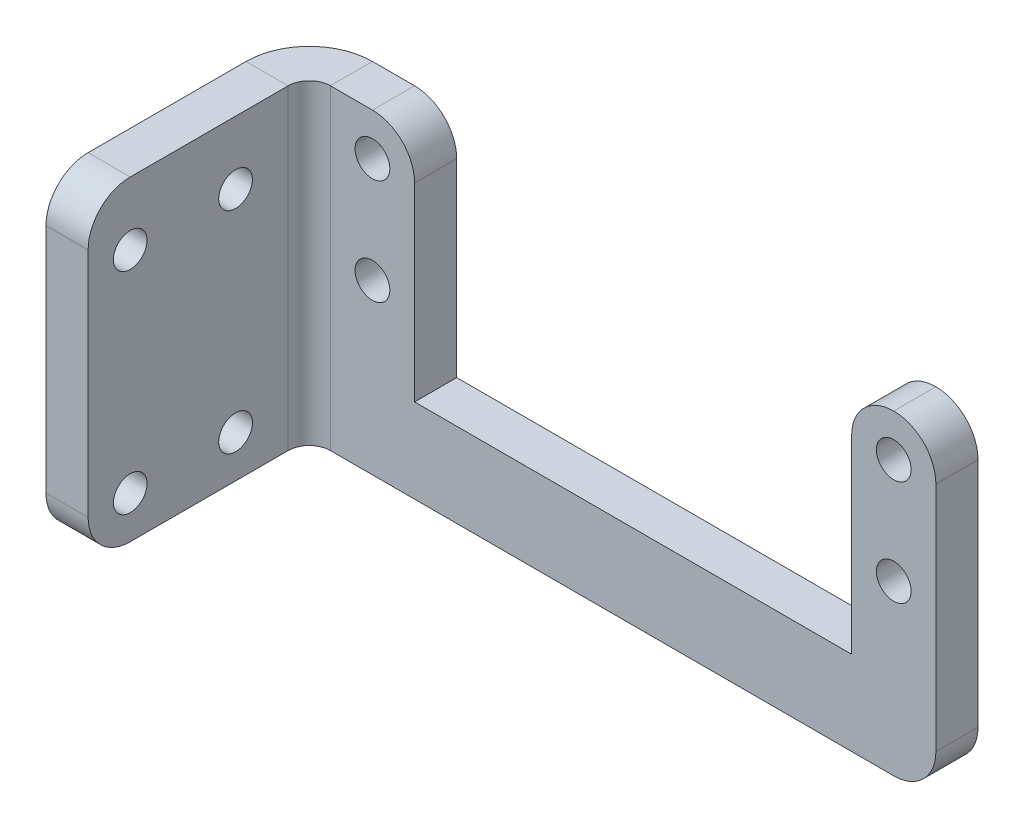
ISO-10303-21;
HEADER;
FILE_DESCRIPTION(('STEP AP214'),'2;1');
FILE_NAME('part.step','',(''),(''),'','','');
FILE_SCHEMA(('AUTOMOTIVE_DESIGN { 1 0 10303 214 1 1 1 1 }'));
ENDSEC;
DATA;
#1=APPLICATION_CONTEXT('core data for automotive mechanical design processes');
#2=APPLICATION_PROTOCOL_DEFINITION('international standard','automotive_design',2000,#1);
#3=PRODUCT_CONTEXT('',#1,'mechanical');
#4=PRODUCT('Part','Part','',(#3));
#5=PRODUCT_RELATED_PRODUCT_CATEGORY('part','',(#4));
#6=PRODUCT_DEFINITION_FORMATION('','',#4);
#7=PRODUCT_DEFINITION_CONTEXT('part definition',#1,'design');
#8=PRODUCT_DEFINITION('design','',#6,#7);
#9=PRODUCT_DEFINITION_SHAPE('','',#8);
#10=(LENGTH_UNIT() NAMED_UNIT(*) SI_UNIT(.MILLI.,.METRE.));
#11=(NAMED_UNIT(*) PLANE_ANGLE_UNIT() SI_UNIT($,.RADIAN.));
#12=(NAMED_UNIT(*) SI_UNIT($,.STERADIAN.) SOLID_ANGLE_UNIT());
#13=UNCERTAINTY_MEASURE_WITH_UNIT(LENGTH_MEASURE(1.E-05),#10,'distance_accuracy_value','');
#14=(GEOMETRIC_REPRESENTATION_CONTEXT(3) GLOBAL_UNCERTAINTY_ASSIGNED_CONTEXT((#13)) GLOBAL_UNIT_ASSIGNED_CONTEXT((#10,
#11,#12)) REPRESENTATION_CONTEXT('',''));
#15=CARTESIAN_POINT('',(0.,0.,0.));
#16=DIRECTION('',(0.,0.,1.));
#17=DIRECTION('',(1.,0.,0.));
#18=AXIS2_PLACEMENT_3D('',#15,#16,#17);
#19=CARTESIAN_POINT('',(8.,0.,0.));
#20=DIRECTION('',(1.,0.,0.));
#21=DIRECTION('',(0.,1.,0.));
#22=AXIS2_PLACEMENT_3D('',#19,#20,#21);
#23=PLANE('',#22);
#24=DIRECTION('',(0.,1.,0.));
#25=VECTOR('',#24,1.);
#26=CARTESIAN_POINT('',(8.,0.,0.));
#27=LINE('',#26,#25);
#28=CARTESIAN_POINT('',(8.00000000000001,-22.,0.));
#29=VERTEX_POINT('',#28);
#30=CARTESIAN_POINT('',(8.,-4.,0.));
#31=VERTEX_POINT('',#30);
#32=EDGE_CURVE('E238',#29,#31,#27,.T.);
#33=ORIENTED_EDGE('',*,*,#32,.T.);
#34=DIRECTION('',(0.,0.,-1.));
#35=VECTOR('',#34,1.);
#36=CARTESIAN_POINT('',(8.,-4.,0.));
#37=LINE('',#36,#35);
#38=CARTESIAN_POINT('',(8.00000000000001,-4.,4.));
#39=VERTEX_POINT('',#38);
#40=EDGE_CURVE('E290',#31,#39,#37,.F.);
#41=ORIENTED_EDGE('',*,*,#40,.T.);
#42=DIRECTION('',(0.,1.,0.));
#43=VECTOR('',#42,1.);
#44=CARTESIAN_POINT('',(8.00000000000001,0.,4.));
#45=LINE('',#44,#43);
#46=CARTESIAN_POINT('',(8.00000000000001,-22.,4.));
#47=VERTEX_POINT('',#46);
#48=EDGE_CURVE('E265',#47,#39,#45,.T.);
#49=ORIENTED_EDGE('',*,*,#48,.F.);
#50=DIRECTION('',(0.,0.,-1.));
#51=VECTOR('',#50,1.);
#52=CARTESIAN_POINT('',(8.00000000000001,-22.,0.));
#53=LINE('',#52,#51);
#54=EDGE_CURVE('E275',#47,#29,#53,.T.);
#55=ORIENTED_EDGE('',*,*,#54,.T.);
#56=EDGE_LOOP('',(#33,#41,#49,#55));
#57=FACE_BOUND('',#56,.T.);
#58=ADVANCED_FACE('F57',(#57),#23,.T.);
#59=CARTESIAN_POINT('',(8.00000000000001,-22.,0.));
#60=DIRECTION('',(0.,1.,0.));
#61=DIRECTION('',(-1.,0.,0.));
#62=AXIS2_PLACEMENT_3D('',#59,#60,#61);
#63=PLANE('',#62);
#64=ORIENTED_EDGE('',*,*,#54,.F.);
#65=DIRECTION('',(1.,0.,0.));
#66=VECTOR('',#65,1.);
#67=CARTESIAN_POINT('',(0.,-22.,4.));
#68=LINE('',#67,#66);
#69=CARTESIAN_POINT('',(49.5,-22.,4.));
#70=VERTEX_POINT('',#69);
#71=EDGE_CURVE('E262',#70,#47,#68,.F.);
#72=ORIENTED_EDGE('',*,*,#71,.F.);
#73=DIRECTION('',(0.,0.,-1.));
#74=VECTOR('',#73,1.);
#75=CARTESIAN_POINT('',(49.5,-22.,0.));
#76=LINE('',#75,#74);
#77=CARTESIAN_POINT('',(49.5,-22.,0.));
#78=VERTEX_POINT('',#77);
#79=EDGE_CURVE('E272',#70,#78,#76,.T.);
#80=ORIENTED_EDGE('',*,*,#79,.T.);
#81=DIRECTION('',(-1.,0.,0.));
#82=VECTOR('',#81,1.);
#83=CARTESIAN_POINT('',(8.00000000000001,-22.,0.));
#84=LINE('',#83,#82);
#85=EDGE_CURVE('E241',#78,#29,#84,.T.);
#86=ORIENTED_EDGE('',*,*,#85,.T.);
#87=EDGE_LOOP('',(#64,#72,#80,#86));
#88=FACE_BOUND('',#87,.T.);
#89=ADVANCED_FACE('F390',(#88),#63,.T.);
#90=CARTESIAN_POINT('',(49.5,-22.,0.));
#91=DIRECTION('',(-1.,0.,0.));
#92=DIRECTION('',(0.,-1.,0.));
#93=AXIS2_PLACEMENT_3D('',#90,#91,#92);
#94=PLANE('',#93);
#95=DIRECTION('',(0.,1.,0.));
#96=VECTOR('',#95,1.);
#97=CARTESIAN_POINT('',(49.5,0.,4.));
#98=LINE('',#97,#96);
#99=CARTESIAN_POINT('',(49.5,-4.,4.));
#100=VERTEX_POINT('',#99);
#101=EDGE_CURVE('E260',#100,#70,#98,.F.);
#102=ORIENTED_EDGE('',*,*,#101,.F.);
#103=DIRECTION('',(0.,0.,-1.));
#104=VECTOR('',#103,1.);
#105=CARTESIAN_POINT('',(49.5,-4.,0.));
#106=LINE('',#105,#104);
#107=CARTESIAN_POINT('',(49.5,-4.,0.));
#108=VERTEX_POINT('',#107);
#109=EDGE_CURVE('E300',#100,#108,#106,.T.);
#110=ORIENTED_EDGE('',*,*,#109,.T.);
#111=DIRECTION('',(0.,-1.,0.));
#112=VECTOR('',#111,1.);
#113=CARTESIAN_POINT('',(49.5,-22.,0.));
#114=LINE('',#113,#112);
#115=EDGE_CURVE('E244',#108,#78,#114,.T.);
#116=ORIENTED_EDGE('',*,*,#115,.T.);
#117=ORIENTED_EDGE('',*,*,#79,.F.);
#118=EDGE_LOOP('',(#102,#110,#116,#117));
#119=FACE_BOUND('',#118,.T.);
#120=ADVANCED_FACE('F396',(#119),#94,.T.);
#121=CARTESIAN_POINT('',(57.5,0.,0.));
#122=DIRECTION('',(1.,0.,0.));
#123=DIRECTION('',(0.,1.,0.));
#124=AXIS2_PLACEMENT_3D('',#121,#122,#123);
#125=PLANE('',#124);
#126=DIRECTION('',(0.,1.,0.));
#127=VECTOR('',#126,1.);
#128=CARTESIAN_POINT('',(57.5,0.,0.));
#129=LINE('',#128,#127);
#130=CARTESIAN_POINT('',(57.5,-26.,0.));
#131=VERTEX_POINT('',#130);
#132=CARTESIAN_POINT('',(57.5,-4.,0.));
#133=VERTEX_POINT('',#132);
#134=EDGE_CURVE('E246',#131,#133,#129,.T.);
#135=ORIENTED_EDGE('',*,*,#134,.T.);
#136=DIRECTION('',(0.,0.,-1.));
#137=VECTOR('',#136,1.);
#138=CARTESIAN_POINT('',(57.5,-4.,0.));
#139=LINE('',#138,#137);
#140=CARTESIAN_POINT('',(57.5,-4.,4.));
#141=VERTEX_POINT('',#140);
#142=EDGE_CURVE('E306',#133,#141,#139,.F.);
#143=ORIENTED_EDGE('',*,*,#142,.T.);
#144=DIRECTION('',(0.,1.,0.));
#145=VECTOR('',#144,1.);
#146=CARTESIAN_POINT('',(57.5,0.,4.));
#147=LINE('',#146,#145);
#148=CARTESIAN_POINT('',(57.5,-26.,4.));
#149=VERTEX_POINT('',#148);
#150=EDGE_CURVE('E257',#149,#141,#147,.T.);
#151=ORIENTED_EDGE('',*,*,#150,.F.);
#152=DIRECTION('',(0.,0.,-1.));
#153=VECTOR('',#152,1.);
#154=CARTESIAN_POINT('',(57.5,-26.,0.));
#155=LINE('',#154,#153);
#156=EDGE_CURVE('E303',#149,#131,#155,.T.);
#157=ORIENTED_EDGE('',*,*,#156,.T.);
#158=EDGE_LOOP('',(#135,#143,#151,#157));
#159=FACE_BOUND('',#158,.T.);
#160=ADVANCED_FACE('F478',(#159),#125,.T.);
#161=CARTESIAN_POINT('',(8.00000000000001,-30.,0.));
#162=DIRECTION('',(0.,-1.,0.));
#163=DIRECTION('',(1.,0.,0.));
#164=AXIS2_PLACEMENT_3D('',#161,#162,#163);
#165=PLANE('',#164);
#166=DIRECTION('',(1.,0.,0.));
#167=VECTOR('',#166,1.);
#168=CARTESIAN_POINT('',(8.00000000000001,-30.,0.));
#169=LINE('',#168,#167);
#170=CARTESIAN_POINT('',(0.,-30.,0.));
#171=VERTEX_POINT('',#170);
#172=CARTESIAN_POINT('',(53.5,-30.,0.));
#173=VERTEX_POINT('',#172);
#174=EDGE_CURVE('E249',#171,#173,#169,.T.);
#175=ORIENTED_EDGE('',*,*,#174,.T.);
#176=DIRECTION('',(0.,0.,-1.));
#177=VECTOR('',#176,1.);
#178=CARTESIAN_POINT('',(53.5,-30.,0.));
#179=LINE('',#178,#177);
#180=CARTESIAN_POINT('',(53.5,-30.,4.));
#181=VERTEX_POINT('',#180);
#182=EDGE_CURVE('E308',#173,#181,#179,.F.);
#183=ORIENTED_EDGE('',*,*,#182,.T.);
#184=DIRECTION('',(1.,0.,0.));
#185=VECTOR('',#184,1.);
#186=CARTESIAN_POINT('',(0.,-30.,4.));
#187=LINE('',#186,#185);
#188=CARTESIAN_POINT('',(0.,-30.,4.));
#189=VERTEX_POINT('',#188);
#190=EDGE_CURVE('E236',#189,#181,#187,.T.);
#191=ORIENTED_EDGE('',*,*,#190,.F.);
#192=DIRECTION('',(0.,0.,-1.));
#193=VECTOR('',#192,1.);
#194=CARTESIAN_POINT('',(0.,-30.,0.));
#195=LINE('',#194,#193);
#196=EDGE_CURVE('E269',#189,#171,#195,.T.);
#197=ORIENTED_EDGE('',*,*,#196,.T.);
#198=EDGE_LOOP('',(#175,#183,#191,#197));
#199=FACE_BOUND('',#198,.T.);
#200=ADVANCED_FACE('F405',(#199),#165,.T.);
#201=CARTESIAN_POINT('',(0.,0.,0.));
#202=DIRECTION('',(0.,1.,0.));
#203=DIRECTION('',(-1.,0.,0.));
#204=AXIS2_PLACEMENT_3D('',#201,#202,#203);
#205=PLANE('',#204);
#206=DIRECTION('',(1.,0.,0.));
#207=VECTOR('',#206,1.);
#208=CARTESIAN_POINT('',(0.,0.,4.));
#209=LINE('',#208,#207);
#210=CARTESIAN_POINT('',(4.,0.,4.));
#211=VERTEX_POINT('',#210);
#212=CARTESIAN_POINT('',(0.,0.,4.));
#213=VERTEX_POINT('',#212);
#214=EDGE_CURVE('E254',#211,#213,#209,.F.);
#215=ORIENTED_EDGE('',*,*,#214,.F.);
#216=DIRECTION('',(0.,0.,-1.));
#217=VECTOR('',#216,1.);
#218=CARTESIAN_POINT('',(4.,0.,0.));
#219=LINE('',#218,#217);
#220=CARTESIAN_POINT('',(4.,0.,0.));
#221=VERTEX_POINT('',#220);
#222=EDGE_CURVE('E277',#211,#221,#219,.T.);
#223=ORIENTED_EDGE('',*,*,#222,.T.);
#224=DIRECTION('',(-1.,0.,0.));
#225=VECTOR('',#224,1.);
#226=CARTESIAN_POINT('',(0.,0.,0.));
#227=LINE('',#226,#225);
#228=CARTESIAN_POINT('',(0.,0.,0.));
#229=VERTEX_POINT('',#228);
#230=EDGE_CURVE('E235',#221,#229,#227,.T.);
#231=ORIENTED_EDGE('',*,*,#230,.T.);
#232=DIRECTION('',(0.,0.,-1.));
#233=VECTOR('',#232,1.);
#234=CARTESIAN_POINT('',(0.,0.,0.));
#235=LINE('',#234,#233);
#236=EDGE_CURVE('E252',#213,#229,#235,.T.);
#237=ORIENTED_EDGE('',*,*,#236,.F.);
#238=EDGE_LOOP('',(#215,#223,#231,#237));
#239=FACE_BOUND('',#238,.T.);
#240=ADVANCED_FACE('F401',(#239),#205,.T.);
#241=CARTESIAN_POINT('',(0.,0.,0.));
#242=DIRECTION('',(0.,0.,1.));
#243=DIRECTION('',(1.,0.,0.));
#244=AXIS2_PLACEMENT_3D('',#241,#242,#243);
#245=PLANE('',#244);
#246=CARTESIAN_POINT('',(53.5,-4.,0.));
#247=DIRECTION('',(0.,0.,-1.));
#248=DIRECTION('',(-1.,0.,0.));
#249=AXIS2_PLACEMENT_3D('',#246,#247,#248);
#250=CIRCLE('',#249,1.64999999999998);
#251=CARTESIAN_POINT('',(51.85,-4.,0.));
#252=VERTEX_POINT('',#251);
#253=EDGE_CURVE('E647',#252,#252,#250,.T.);
#254=ORIENTED_EDGE('',*,*,#253,.F.);
#255=EDGE_LOOP('',(#254));
#256=FACE_BOUND('',#255,.T.);
#257=CARTESIAN_POINT('',(53.5,-14.,0.));
#258=DIRECTION('',(0.,0.,-1.));
#259=DIRECTION('',(-1.,0.,0.));
#260=AXIS2_PLACEMENT_3D('',#257,#258,#259);
#261=CIRCLE('',#260,1.64999999999998);
#262=CARTESIAN_POINT('',(51.85,-14.,0.));
#263=VERTEX_POINT('',#262);
#264=EDGE_CURVE('E341',#263,#263,#261,.T.);
#265=ORIENTED_EDGE('',*,*,#264,.F.);
#266=EDGE_LOOP('',(#265));
#267=FACE_BOUND('',#266,.T.);
#268=CARTESIAN_POINT('',(4.,-4.,0.));
#269=DIRECTION('',(0.,0.,-1.));
#270=DIRECTION('',(-1.,0.,0.));
#271=AXIS2_PLACEMENT_3D('',#268,#269,#270);
#272=CIRCLE('',#271,1.64999999999999);
#273=CARTESIAN_POINT('',(2.35000000000002,-4.,0.));
#274=VERTEX_POINT('',#273);
#275=EDGE_CURVE('E329',#274,#274,#272,.T.);
#276=ORIENTED_EDGE('',*,*,#275,.F.);
#277=EDGE_LOOP('',(#276));
#278=FACE_BOUND('',#277,.T.);
#279=CARTESIAN_POINT('',(4.,-14.,0.));
#280=DIRECTION('',(0.,0.,-1.));
#281=DIRECTION('',(-1.,0.,0.));
#282=AXIS2_PLACEMENT_3D('',#279,#280,#281);
#283=CIRCLE('',#282,1.64999999999999);
#284=CARTESIAN_POINT('',(2.35000000000002,-14.,0.));
#285=VERTEX_POINT('',#284);
#286=EDGE_CURVE('E328',#285,#285,#283,.T.);
#287=ORIENTED_EDGE('',*,*,#286,.F.);
#288=EDGE_LOOP('',(#287));
#289=FACE_BOUND('',#288,.T.);
#290=ORIENTED_EDGE('',*,*,#230,.F.);
#291=CARTESIAN_POINT('',(4.,-4.,0.));
#292=DIRECTION('',(0.,0.,1.));
#293=DIRECTION('',(1.,0.,0.));
#294=AXIS2_PLACEMENT_3D('',#291,#292,#293);
#295=CIRCLE('',#294,4.);
#296=EDGE_CURVE('E288',#221,#31,#295,.F.);
#297=ORIENTED_EDGE('',*,*,#296,.T.);
#298=ORIENTED_EDGE('',*,*,#32,.F.);
#299=ORIENTED_EDGE('',*,*,#85,.F.);
#300=ORIENTED_EDGE('',*,*,#115,.F.);
#301=CARTESIAN_POINT('',(53.5,-4.,0.));
#302=DIRECTION('',(0.,0.,1.));
#303=DIRECTION('',(1.,0.,0.));
#304=AXIS2_PLACEMENT_3D('',#301,#302,#303);
#305=CIRCLE('',#304,4.);
#306=CARTESIAN_POINT('',(53.5,0.,0.));
#307=VERTEX_POINT('',#306);
#308=EDGE_CURVE('E286',#108,#307,#305,.F.);
#309=ORIENTED_EDGE('',*,*,#308,.T.);
#310=CARTESIAN_POINT('',(53.5,-4.,0.));
#311=DIRECTION('',(0.,0.,1.));
#312=DIRECTION('',(1.,0.,0.));
#313=AXIS2_PLACEMENT_3D('',#310,#311,#312);
#314=CIRCLE('',#313,4.);
#315=EDGE_CURVE('E284',#307,#133,#314,.F.);
#316=ORIENTED_EDGE('',*,*,#315,.T.);
#317=ORIENTED_EDGE('',*,*,#134,.F.);
#318=CARTESIAN_POINT('',(53.5,-26.,0.));
#319=DIRECTION('',(0.,0.,1.));
#320=DIRECTION('',(1.,0.,0.));
#321=AXIS2_PLACEMENT_3D('',#318,#319,#320);
#322=CIRCLE('',#321,4.);
#323=EDGE_CURVE('E282',#131,#173,#322,.F.);
#324=ORIENTED_EDGE('',*,*,#323,.T.);
#325=ORIENTED_EDGE('',*,*,#174,.F.);
#326=DIRECTION('',(0.,-1.,0.));
#327=VECTOR('',#326,1.);
#328=CARTESIAN_POINT('',(0.,0.,0.));
#329=LINE('',#328,#327);
#330=EDGE_CURVE('E189',#229,#171,#329,.T.);
#331=ORIENTED_EDGE('',*,*,#330,.F.);
#332=EDGE_LOOP('',(#290,#297,#298,#299,#300,#309,#316,#317,#324,#325,#331));
#333=FACE_BOUND('',#332,.T.);
#334=ADVANCED_FACE('F404',(#256,#267,#278,#289,#333),#245,.F.);
#335=CARTESIAN_POINT('',(0.,0.,4.));
#336=DIRECTION('',(0.,0.,1.));
#337=DIRECTION('',(1.,0.,0.));
#338=AXIS2_PLACEMENT_3D('',#335,#336,#337);
#339=PLANE('',#338);
#340=CARTESIAN_POINT('',(53.5,-4.,4.));
#341=DIRECTION('',(0.,0.,1.));
#342=DIRECTION('',(1.,0.,0.));
#343=AXIS2_PLACEMENT_3D('',#340,#341,#342);
#344=CIRCLE('',#343,1.64999999999998);
#345=CARTESIAN_POINT('',(55.15,-4.,4.));
#346=VERTEX_POINT('',#345);
#347=EDGE_CURVE('E61',#346,#346,#344,.T.);
#348=ORIENTED_EDGE('',*,*,#347,.F.);
#349=EDGE_LOOP('',(#348));
#350=FACE_BOUND('',#349,.T.);
#351=CARTESIAN_POINT('',(53.5,-14.,4.));
#352=DIRECTION('',(0.,0.,1.));
#353=DIRECTION('',(1.,0.,0.));
#354=AXIS2_PLACEMENT_3D('',#351,#352,#353);
#355=CIRCLE('',#354,1.64999999999998);
#356=CARTESIAN_POINT('',(55.15,-14.,4.));
#357=VERTEX_POINT('',#356);
#358=EDGE_CURVE('E336',#357,#357,#355,.T.);
#359=ORIENTED_EDGE('',*,*,#358,.F.);
#360=EDGE_LOOP('',(#359));
#361=FACE_BOUND('',#360,.T.);
#362=CARTESIAN_POINT('',(4.,-4.,4.));
#363=DIRECTION('',(0.,0.,1.));
#364=DIRECTION('',(1.,0.,0.));
#365=AXIS2_PLACEMENT_3D('',#362,#363,#364);
#366=CIRCLE('',#365,1.64999999999999);
#367=CARTESIAN_POINT('',(5.64999999999999,-4.,4.));
#368=VERTEX_POINT('',#367);
#369=EDGE_CURVE('E326',#368,#368,#366,.T.);
#370=ORIENTED_EDGE('',*,*,#369,.F.);
#371=EDGE_LOOP('',(#370));
#372=FACE_BOUND('',#371,.T.);
#373=CARTESIAN_POINT('',(4.,-14.,4.));
#374=DIRECTION('',(0.,0.,1.));
#375=DIRECTION('',(1.,0.,0.));
#376=AXIS2_PLACEMENT_3D('',#373,#374,#375);
#377=CIRCLE('',#376,1.64999999999999);
#378=CARTESIAN_POINT('',(5.64999999999999,-14.,4.));
#379=VERTEX_POINT('',#378);
#380=EDGE_CURVE('E333',#379,#379,#377,.T.);
#381=ORIENTED_EDGE('',*,*,#380,.F.);
#382=EDGE_LOOP('',(#381));
#383=FACE_BOUND('',#382,.T.);
#384=ORIENTED_EDGE('',*,*,#48,.T.);
#385=CARTESIAN_POINT('',(4.,-4.,4.));
#386=DIRECTION('',(0.,0.,1.));
#387=DIRECTION('',(1.,0.,0.));
#388=AXIS2_PLACEMENT_3D('',#385,#386,#387);
#389=CIRCLE('',#388,4.);
#390=EDGE_CURVE('E298',#39,#211,#389,.T.);
#391=ORIENTED_EDGE('',*,*,#390,.T.);
#392=ORIENTED_EDGE('',*,*,#214,.T.);
#393=DIRECTION('',(0.,1.,0.));
#394=VECTOR('',#393,1.);
#395=CARTESIAN_POINT('',(0.,0.,4.));
#396=LINE('',#395,#394);
#397=EDGE_CURVE('E229',#213,#189,#396,.F.);
#398=ORIENTED_EDGE('',*,*,#397,.T.);
#399=ORIENTED_EDGE('',*,*,#190,.T.);
#400=CARTESIAN_POINT('',(53.5,-26.,4.));
#401=DIRECTION('',(0.,0.,1.));
#402=DIRECTION('',(1.,0.,0.));
#403=AXIS2_PLACEMENT_3D('',#400,#401,#402);
#404=CIRCLE('',#403,4.);
#405=EDGE_CURVE('E292',#181,#149,#404,.T.);
#406=ORIENTED_EDGE('',*,*,#405,.T.);
#407=ORIENTED_EDGE('',*,*,#150,.T.);
#408=CARTESIAN_POINT('',(53.5,-4.,4.));
#409=DIRECTION('',(0.,0.,1.));
#410=DIRECTION('',(1.,0.,0.));
#411=AXIS2_PLACEMENT_3D('',#408,#409,#410);
#412=CIRCLE('',#411,4.);
#413=CARTESIAN_POINT('',(53.5,0.,4.));
#414=VERTEX_POINT('',#413);
#415=EDGE_CURVE('E294',#141,#414,#412,.T.);
#416=ORIENTED_EDGE('',*,*,#415,.T.);
#417=CARTESIAN_POINT('',(53.5,-4.,4.));
#418=DIRECTION('',(0.,0.,1.));
#419=DIRECTION('',(1.,0.,0.));
#420=AXIS2_PLACEMENT_3D('',#417,#418,#419);
#421=CIRCLE('',#420,4.);
#422=EDGE_CURVE('E296',#414,#100,#421,.T.);
#423=ORIENTED_EDGE('',*,*,#422,.T.);
#424=ORIENTED_EDGE('',*,*,#101,.T.);
#425=ORIENTED_EDGE('',*,*,#71,.T.);
#426=EDGE_LOOP('',(#384,#391,#392,#398,#399,#406,#407,#416,#423,#424,#425));
#427=FACE_BOUND('',#426,.T.);
#428=ADVANCED_FACE('F467',(#350,#361,#372,#383,#427),#339,.T.);
#429=CARTESIAN_POINT('',(0.,0.,6.));
#430=DIRECTION('',(0.,1.,0.));
#431=DIRECTION('',(-1.,0.,0.));
#432=AXIS2_PLACEMENT_3D('',#429,#430,#431);
#433=PLANE('',#432);
#434=DIRECTION('',(1.,0.,0.));
#435=VECTOR('',#434,1.);
#436=CARTESIAN_POINT('',(-6.,0.,5.99999999999998));
#437=LINE('',#436,#435);
#438=CARTESIAN_POINT('',(-2.,0.,5.99999999999999));
#439=VERTEX_POINT('',#438);
#440=CARTESIAN_POINT('',(-6.,0.,5.99999999999998));
#441=VERTEX_POINT('',#440);
#442=EDGE_CURVE('E225',#439,#441,#437,.F.);
#443=ORIENTED_EDGE('',*,*,#442,.F.);
#444=CARTESIAN_POINT('',(0.,0.,6.));
#445=DIRECTION('',(0.,-1.,0.));
#446=DIRECTION('',(1.,0.,0.));
#447=AXIS2_PLACEMENT_3D('',#444,#445,#446);
#448=CIRCLE('',#447,2.);
#449=EDGE_CURVE('E193',#213,#439,#448,.F.);
#450=ORIENTED_EDGE('',*,*,#449,.F.);
#451=ORIENTED_EDGE('',*,*,#236,.T.);
#452=CARTESIAN_POINT('',(0.,0.,6.));
#453=DIRECTION('',(0.,-1.,0.));
#454=DIRECTION('',(1.,0.,0.));
#455=AXIS2_PLACEMENT_3D('',#452,#453,#454);
#456=CIRCLE('',#455,6.);
#457=EDGE_CURVE('E192',#229,#441,#456,.F.);
#458=ORIENTED_EDGE('',*,*,#457,.T.);
#459=EDGE_LOOP('',(#443,#450,#451,#458));
#460=FACE_BOUND('',#459,.T.);
#461=ADVANCED_FACE('F439',(#460),#433,.T.);
#462=CARTESIAN_POINT('',(0.,-30.,6.));
#463=DIRECTION('',(0.,1.,0.));
#464=DIRECTION('',(-1.,0.,0.));
#465=AXIS2_PLACEMENT_3D('',#462,#463,#464);
#466=PLANE('',#465);
#467=CARTESIAN_POINT('',(0.,-30.,6.));
#468=DIRECTION('',(0.,-1.,0.));
#469=DIRECTION('',(1.,0.,0.));
#470=AXIS2_PLACEMENT_3D('',#467,#468,#469);
#471=CIRCLE('',#470,2.);
#472=CARTESIAN_POINT('',(-1.99999999999999,-30.,5.99999999999999));
#473=VERTEX_POINT('',#472);
#474=EDGE_CURVE('E200',#473,#189,#471,.T.);
#475=ORIENTED_EDGE('',*,*,#474,.F.);
#476=DIRECTION('',(1.,0.,0.));
#477=VECTOR('',#476,1.);
#478=CARTESIAN_POINT('',(-1.99999999999999,-30.,5.99999999999999));
#479=LINE('',#478,#477);
#480=CARTESIAN_POINT('',(-5.99999999999999,-30.,5.99999999999998));
#481=VERTEX_POINT('',#480);
#482=EDGE_CURVE('E197',#473,#481,#479,.F.);
#483=ORIENTED_EDGE('',*,*,#482,.T.);
#484=CARTESIAN_POINT('',(0.,-30.,6.));
#485=DIRECTION('',(0.,-1.,0.));
#486=DIRECTION('',(1.,0.,0.));
#487=AXIS2_PLACEMENT_3D('',#484,#485,#486);
#488=CIRCLE('',#487,6.);
#489=EDGE_CURVE('E181',#481,#171,#488,.T.);
#490=ORIENTED_EDGE('',*,*,#489,.T.);
#491=ORIENTED_EDGE('',*,*,#196,.F.);
#492=EDGE_LOOP('',(#475,#483,#490,#491));
#493=FACE_BOUND('',#492,.T.);
#494=ADVANCED_FACE('F198',(#493),#466,.F.);
#495=CARTESIAN_POINT('',(0.,-30.,6.));
#496=DIRECTION('',(0.,-1.,0.));
#497=DIRECTION('',(-1.,0.,0.));
#498=AXIS2_PLACEMENT_3D('',#495,#496,#497);
#499=CYLINDRICAL_SURFACE('',#498,6.);
#500=ORIENTED_EDGE('',*,*,#330,.T.);
#501=ORIENTED_EDGE('',*,*,#489,.F.);
#502=DIRECTION('',(0.,-1.,0.));
#503=VECTOR('',#502,1.);
#504=CARTESIAN_POINT('',(-6.,0.,5.99999999999998));
#505=LINE('',#504,#503);
#506=EDGE_CURVE('E186',#481,#441,#505,.F.);
#507=ORIENTED_EDGE('',*,*,#506,.T.);
#508=ORIENTED_EDGE('',*,*,#457,.F.);
#509=EDGE_LOOP('',(#500,#501,#507,#508));
#510=FACE_BOUND('',#509,.T.);
#511=ADVANCED_FACE('F183',(#510),#499,.T.);
#512=CARTESIAN_POINT('',(0.,-30.,6.));
#513=DIRECTION('',(0.,-1.,0.));
#514=DIRECTION('',(-1.,0.,0.));
#515=AXIS2_PLACEMENT_3D('',#512,#513,#514);
#516=CYLINDRICAL_SURFACE('',#515,2.);
#517=ORIENTED_EDGE('',*,*,#397,.F.);
#518=ORIENTED_EDGE('',*,*,#449,.T.);
#519=DIRECTION('',(0.,-1.,0.));
#520=VECTOR('',#519,1.);
#521=CARTESIAN_POINT('',(-2.,0.,5.99999999999999));
#522=LINE('',#521,#520);
#523=EDGE_CURVE('E202',#439,#473,#522,.T.);
#524=ORIENTED_EDGE('',*,*,#523,.T.);
#525=ORIENTED_EDGE('',*,*,#474,.T.);
#526=EDGE_LOOP('',(#517,#518,#524,#525));
#527=FACE_BOUND('',#526,.T.);
#528=ADVANCED_FACE('F443',(#527),#516,.F.);
#529=CARTESIAN_POINT('',(-5.99999999999999,0.,3.99999999999999));
#530=DIRECTION('',(0.,-1.,0.));
#531=DIRECTION('',(1.,0.,0.));
#532=AXIS2_PLACEMENT_3D('',#529,#530,#531);
#533=PLANE('',#532);
#534=DIRECTION('',(0.,0.,-1.));
#535=VECTOR('',#534,1.);
#536=CARTESIAN_POINT('',(-5.99999999999998,0.,0.));
#537=LINE('',#536,#535);
#538=CARTESIAN_POINT('',(-6.00000000000005,0.,21.));
#539=VERTEX_POINT('',#538);
#540=EDGE_CURVE('E209',#539,#441,#537,.T.);
#541=ORIENTED_EDGE('',*,*,#540,.F.);
#542=DIRECTION('',(1.,0.,0.));
#543=VECTOR('',#542,1.);
#544=CARTESIAN_POINT('',(-6.00000000000005,0.,21.));
#545=LINE('',#544,#543);
#546=CARTESIAN_POINT('',(-2.00000000000005,0.,21.));
#547=VERTEX_POINT('',#546);
#548=EDGE_CURVE('E310',#539,#547,#545,.T.);
#549=ORIENTED_EDGE('',*,*,#548,.T.);
#550=DIRECTION('',(0.,0.,1.));
#551=VECTOR('',#550,1.);
#552=CARTESIAN_POINT('',(-1.99999999999999,0.,4.));
#553=LINE('',#552,#551);
#554=EDGE_CURVE('E210',#547,#439,#553,.F.);
#555=ORIENTED_EDGE('',*,*,#554,.T.);
#556=ORIENTED_EDGE('',*,*,#442,.T.);
#557=EDGE_LOOP('',(#541,#549,#555,#556));
#558=FACE_BOUND('',#557,.T.);
#559=ADVANCED_FACE('F434',(#558),#533,.F.);
#560=CARTESIAN_POINT('',(-6.00000000000006,-30.,25.));
#561=DIRECTION('',(0.,1.,0.));
#562=DIRECTION('',(-1.,0.,0.));
#563=AXIS2_PLACEMENT_3D('',#560,#561,#562);
#564=PLANE('',#563);
#565=DIRECTION('',(0.,0.,-1.));
#566=VECTOR('',#565,1.);
#567=CARTESIAN_POINT('',(-2.00000000000006,-30.,25.));
#568=LINE('',#567,#566);
#569=CARTESIAN_POINT('',(-2.00000000000004,-30.,21.));
#570=VERTEX_POINT('',#569);
#571=EDGE_CURVE('E221',#473,#570,#568,.F.);
#572=ORIENTED_EDGE('',*,*,#571,.T.);
#573=DIRECTION('',(1.,0.,0.));
#574=VECTOR('',#573,1.);
#575=CARTESIAN_POINT('',(-6.00000000000004,-30.,21.));
#576=LINE('',#575,#574);
#577=CARTESIAN_POINT('',(-6.00000000000004,-30.,21.));
#578=VERTEX_POINT('',#577);
#579=EDGE_CURVE('E13',#570,#578,#576,.F.);
#580=ORIENTED_EDGE('',*,*,#579,.T.);
#581=DIRECTION('',(0.,0.,1.));
#582=VECTOR('',#581,1.);
#583=CARTESIAN_POINT('',(-5.99999999999997,-30.,0.));
#584=LINE('',#583,#582);
#585=EDGE_CURVE('E206',#481,#578,#584,.T.);
#586=ORIENTED_EDGE('',*,*,#585,.F.);
#587=ORIENTED_EDGE('',*,*,#482,.F.);
#588=EDGE_LOOP('',(#572,#580,#586,#587));
#589=FACE_BOUND('',#588,.T.);
#590=ADVANCED_FACE('F212',(#589),#564,.F.);
#591=CARTESIAN_POINT('',(-5.99999999999998,0.,0.));
#592=DIRECTION('',(1.,0.,0.));
#593=DIRECTION('',(0.,0.,-1.));
#594=AXIS2_PLACEMENT_3D('',#591,#592,#593);
#595=PLANE('',#594);
#596=CARTESIAN_POINT('',(-6.00000000000005,-6.,21.0000000000001));
#597=DIRECTION('',(1.,0.,0.));
#598=DIRECTION('',(0.,0.,-1.));
#599=AXIS2_PLACEMENT_3D('',#596,#597,#598);
#600=CIRCLE('',#599,1.6);
#601=CARTESIAN_POINT('',(-6.00000000000005,-6.,19.4000000000001));
#602=VERTEX_POINT('',#601);
#603=EDGE_CURVE('E325',#602,#602,#600,.T.);
#604=ORIENTED_EDGE('',*,*,#603,.T.);
#605=EDGE_LOOP('',(#604));
#606=FACE_BOUND('',#605,.T.);
#607=CARTESIAN_POINT('',(-6.00000000000002,-6.,11.0000000000001));
#608=DIRECTION('',(1.,0.,0.));
#609=DIRECTION('',(0.,0.,-1.));
#610=AXIS2_PLACEMENT_3D('',#607,#608,#609);
#611=CIRCLE('',#610,1.6);
#612=CARTESIAN_POINT('',(-6.00000000000001,-6.,9.40000000000006));
#613=VERTEX_POINT('',#612);
#614=EDGE_CURVE('E365',#613,#613,#611,.T.);
#615=ORIENTED_EDGE('',*,*,#614,.T.);
#616=EDGE_LOOP('',(#615));
#617=FACE_BOUND('',#616,.T.);
#618=CARTESIAN_POINT('',(-6.00000000000001,-26.,11.));
#619=DIRECTION('',(1.,0.,0.));
#620=DIRECTION('',(0.,0.,-1.));
#621=AXIS2_PLACEMENT_3D('',#618,#619,#620);
#622=CIRCLE('',#621,1.6);
#623=CARTESIAN_POINT('',(-6.,-26.,9.39999999999999));
#624=VERTEX_POINT('',#623);
#625=EDGE_CURVE('E362',#624,#624,#622,.T.);
#626=ORIENTED_EDGE('',*,*,#625,.T.);
#627=EDGE_LOOP('',(#626));
#628=FACE_BOUND('',#627,.T.);
#629=CARTESIAN_POINT('',(-6.00000000000005,-26.,21.));
#630=DIRECTION('',(1.,0.,0.));
#631=DIRECTION('',(0.,0.,-1.));
#632=AXIS2_PLACEMENT_3D('',#629,#630,#631);
#633=CIRCLE('',#632,1.6);
#634=CARTESIAN_POINT('',(-6.00000000000004,-26.,19.4));
#635=VERTEX_POINT('',#634);
#636=EDGE_CURVE('E359',#635,#635,#633,.T.);
#637=ORIENTED_EDGE('',*,*,#636,.T.);
#638=EDGE_LOOP('',(#637));
#639=FACE_BOUND('',#638,.T.);
#640=DIRECTION('',(0.,1.,0.));
#641=VECTOR('',#640,1.);
#642=CARTESIAN_POINT('',(-6.00000000000007,0.,25.));
#643=LINE('',#642,#641);
#644=CARTESIAN_POINT('',(-6.00000000000006,-26.,25.));
#645=VERTEX_POINT('',#644);
#646=CARTESIAN_POINT('',(-6.00000000000007,-4.,25.));
#647=VERTEX_POINT('',#646);
#648=EDGE_CURVE('E213',#645,#647,#643,.T.);
#649=ORIENTED_EDGE('',*,*,#648,.T.);
#650=CARTESIAN_POINT('',(-6.00000000000005,-4.,21.));
#651=DIRECTION('',(1.,0.,0.));
#652=DIRECTION('',(0.,0.,-1.));
#653=AXIS2_PLACEMENT_3D('',#650,#651,#652);
#654=CIRCLE('',#653,4.);
#655=EDGE_CURVE('E66',#647,#539,#654,.F.);
#656=ORIENTED_EDGE('',*,*,#655,.T.);
#657=ORIENTED_EDGE('',*,*,#540,.T.);
#658=ORIENTED_EDGE('',*,*,#506,.F.);
#659=ORIENTED_EDGE('',*,*,#585,.T.);
#660=CARTESIAN_POINT('',(-6.00000000000005,-26.,21.));
#661=DIRECTION('',(1.,0.,0.));
#662=DIRECTION('',(0.,0.,-1.));
#663=AXIS2_PLACEMENT_3D('',#660,#661,#662);
#664=CIRCLE('',#663,4.);
#665=EDGE_CURVE('E321',#578,#645,#664,.F.);
#666=ORIENTED_EDGE('',*,*,#665,.T.);
#667=EDGE_LOOP('',(#649,#656,#657,#658,#659,#666));
#668=FACE_BOUND('',#667,.T.);
#669=ADVANCED_FACE('F205',(#606,#617,#628,#639,#668),#595,.F.);
#670=CARTESIAN_POINT('',(-1.99999999999998,0.,0.));
#671=DIRECTION('',(1.,0.,0.));
#672=DIRECTION('',(0.,0.,-1.));
#673=AXIS2_PLACEMENT_3D('',#670,#671,#672);
#674=PLANE('',#673);
#675=CARTESIAN_POINT('',(-2.00000000000005,-6.,21.0000000000001));
#676=DIRECTION('',(1.,0.,0.));
#677=DIRECTION('',(0.,0.,-1.));
#678=AXIS2_PLACEMENT_3D('',#675,#676,#677);
#679=CIRCLE('',#678,1.6);
#680=CARTESIAN_POINT('',(-2.00000000000005,-6.,19.4000000000001));
#681=VERTEX_POINT('',#680);
#682=EDGE_CURVE('E347',#681,#681,#679,.T.);
#683=ORIENTED_EDGE('',*,*,#682,.F.);
#684=EDGE_LOOP('',(#683));
#685=FACE_BOUND('',#684,.T.);
#686=CARTESIAN_POINT('',(-2.00000000000002,-6.,11.0000000000001));
#687=DIRECTION('',(1.,0.,0.));
#688=DIRECTION('',(0.,0.,-1.));
#689=AXIS2_PLACEMENT_3D('',#686,#687,#688);
#690=CIRCLE('',#689,1.6);
#691=CARTESIAN_POINT('',(-2.00000000000001,-6.,9.40000000000007));
#692=VERTEX_POINT('',#691);
#693=EDGE_CURVE('E352',#692,#692,#690,.T.);
#694=ORIENTED_EDGE('',*,*,#693,.F.);
#695=EDGE_LOOP('',(#694));
#696=FACE_BOUND('',#695,.T.);
#697=CARTESIAN_POINT('',(-2.00000000000001,-26.,11.));
#698=DIRECTION('',(1.,0.,0.));
#699=DIRECTION('',(0.,0.,-1.));
#700=AXIS2_PLACEMENT_3D('',#697,#698,#699);
#701=CIRCLE('',#700,1.6);
#702=CARTESIAN_POINT('',(-2.,-26.,9.40000000000001));
#703=VERTEX_POINT('',#702);
#704=EDGE_CURVE('E348',#703,#703,#701,.T.);
#705=ORIENTED_EDGE('',*,*,#704,.F.);
#706=EDGE_LOOP('',(#705));
#707=FACE_BOUND('',#706,.T.);
#708=CARTESIAN_POINT('',(-2.00000000000005,-26.,21.));
#709=DIRECTION('',(1.,0.,0.));
#710=DIRECTION('',(0.,0.,-1.));
#711=AXIS2_PLACEMENT_3D('',#708,#709,#710);
#712=CIRCLE('',#711,1.6);
#713=CARTESIAN_POINT('',(-2.00000000000004,-26.,19.4));
#714=VERTEX_POINT('',#713);
#715=EDGE_CURVE('E351',#714,#714,#712,.T.);
#716=ORIENTED_EDGE('',*,*,#715,.F.);
#717=EDGE_LOOP('',(#716));
#718=FACE_BOUND('',#717,.T.);
#719=ORIENTED_EDGE('',*,*,#554,.F.);
#720=CARTESIAN_POINT('',(-2.00000000000005,-4.,21.));
#721=DIRECTION('',(1.,0.,0.));
#722=DIRECTION('',(0.,0.,-1.));
#723=AXIS2_PLACEMENT_3D('',#720,#721,#722);
#724=CIRCLE('',#723,4.);
#725=CARTESIAN_POINT('',(-2.00000000000007,-4.,25.));
#726=VERTEX_POINT('',#725);
#727=EDGE_CURVE('E315',#547,#726,#724,.T.);
#728=ORIENTED_EDGE('',*,*,#727,.T.);
#729=DIRECTION('',(0.,-1.,0.));
#730=VECTOR('',#729,1.);
#731=CARTESIAN_POINT('',(-2.00000000000007,0.,25.));
#732=LINE('',#731,#730);
#733=CARTESIAN_POINT('',(-2.00000000000006,-26.,25.));
#734=VERTEX_POINT('',#733);
#735=EDGE_CURVE('E216',#734,#726,#732,.F.);
#736=ORIENTED_EDGE('',*,*,#735,.F.);
#737=CARTESIAN_POINT('',(-2.00000000000005,-26.,21.));
#738=DIRECTION('',(1.,0.,0.));
#739=DIRECTION('',(0.,0.,-1.));
#740=AXIS2_PLACEMENT_3D('',#737,#738,#739);
#741=CIRCLE('',#740,4.);
#742=EDGE_CURVE('E313',#734,#570,#741,.T.);
#743=ORIENTED_EDGE('',*,*,#742,.T.);
#744=ORIENTED_EDGE('',*,*,#571,.F.);
#745=ORIENTED_EDGE('',*,*,#523,.F.);
#746=EDGE_LOOP('',(#719,#728,#736,#743,#744,#745));
#747=FACE_BOUND('',#746,.T.);
#748=ADVANCED_FACE('F445',(#685,#696,#707,#718,#747),#674,.T.);
#749=CARTESIAN_POINT('',(-6.00000000000007,0.,25.));
#750=DIRECTION('',(0.,0.,-1.));
#751=DIRECTION('',(-1.,0.,0.));
#752=AXIS2_PLACEMENT_3D('',#749,#750,#751);
#753=PLANE('',#752);
#754=ORIENTED_EDGE('',*,*,#735,.T.);
#755=DIRECTION('',(1.,0.,0.));
#756=VECTOR('',#755,1.);
#757=CARTESIAN_POINT('',(-6.00000000000007,-4.,25.));
#758=LINE('',#757,#756);
#759=EDGE_CURVE('E80',#726,#647,#758,.F.);
#760=ORIENTED_EDGE('',*,*,#759,.T.);
#761=ORIENTED_EDGE('',*,*,#648,.F.);
#762=DIRECTION('',(1.,0.,0.));
#763=VECTOR('',#762,1.);
#764=CARTESIAN_POINT('',(-6.00000000000006,-26.,25.));
#765=LINE('',#764,#763);
#766=EDGE_CURVE('E317',#645,#734,#765,.T.);
#767=ORIENTED_EDGE('',*,*,#766,.T.);
#768=EDGE_LOOP('',(#754,#760,#761,#767));
#769=FACE_BOUND('',#768,.T.);
#770=ADVANCED_FACE('F411',(#769),#753,.F.);
#771=CARTESIAN_POINT('',(4.,-4.,0.));
#772=DIRECTION('',(0.,0.,-1.));
#773=DIRECTION('',(-1.,0.,0.));
#774=AXIS2_PLACEMENT_3D('',#771,#772,#773);
#775=CYLINDRICAL_SURFACE('',#774,4.);
#776=ORIENTED_EDGE('',*,*,#390,.F.);
#777=ORIENTED_EDGE('',*,*,#40,.F.);
#778=ORIENTED_EDGE('',*,*,#296,.F.);
#779=ORIENTED_EDGE('',*,*,#222,.F.);
#780=EDGE_LOOP('',(#776,#777,#778,#779));
#781=FACE_BOUND('',#780,.T.);
#782=ADVANCED_FACE('F407',(#781),#775,.T.);
#783=CARTESIAN_POINT('',(53.5,-4.,0.));
#784=DIRECTION('',(0.,0.,-1.));
#785=DIRECTION('',(-1.,0.,0.));
#786=AXIS2_PLACEMENT_3D('',#783,#784,#785);
#787=CYLINDRICAL_SURFACE('',#786,4.);
#788=DIRECTION('',(0.,0.,-1.));
#789=VECTOR('',#788,1.);
#790=CARTESIAN_POINT('',(53.5,0.,0.));
#791=LINE('',#790,#789);
#792=EDGE_CURVE('E228',#414,#307,#791,.T.);
#793=ORIENTED_EDGE('',*,*,#792,.F.);
#794=ORIENTED_EDGE('',*,*,#415,.F.);
#795=ORIENTED_EDGE('',*,*,#142,.F.);
#796=ORIENTED_EDGE('',*,*,#315,.F.);
#797=EDGE_LOOP('',(#793,#794,#795,#796));
#798=FACE_BOUND('',#797,.T.);
#799=ADVANCED_FACE('F410',(#798),#787,.T.);
#800=CARTESIAN_POINT('',(53.5,-4.,0.));
#801=DIRECTION('',(0.,0.,-1.));
#802=DIRECTION('',(-1.,0.,0.));
#803=AXIS2_PLACEMENT_3D('',#800,#801,#802);
#804=CYLINDRICAL_SURFACE('',#803,4.);
#805=ORIENTED_EDGE('',*,*,#422,.F.);
#806=ORIENTED_EDGE('',*,*,#792,.T.);
#807=ORIENTED_EDGE('',*,*,#308,.F.);
#808=ORIENTED_EDGE('',*,*,#109,.F.);
#809=EDGE_LOOP('',(#805,#806,#807,#808));
#810=FACE_BOUND('',#809,.T.);
#811=ADVANCED_FACE('F413',(#810),#804,.T.);
#812=CARTESIAN_POINT('',(53.5,-26.,0.));
#813=DIRECTION('',(0.,0.,-1.));
#814=DIRECTION('',(-1.,0.,0.));
#815=AXIS2_PLACEMENT_3D('',#812,#813,#814);
#816=CYLINDRICAL_SURFACE('',#815,4.);
#817=ORIENTED_EDGE('',*,*,#405,.F.);
#818=ORIENTED_EDGE('',*,*,#182,.F.);
#819=ORIENTED_EDGE('',*,*,#323,.F.);
#820=ORIENTED_EDGE('',*,*,#156,.F.);
#821=EDGE_LOOP('',(#817,#818,#819,#820));
#822=FACE_BOUND('',#821,.T.);
#823=ADVANCED_FACE('F416',(#822),#816,.T.);
#824=CARTESIAN_POINT('',(-6.00000000000005,-4.,21.));
#825=DIRECTION('',(1.,0.,0.));
#826=DIRECTION('',(0.,0.,-1.));
#827=AXIS2_PLACEMENT_3D('',#824,#825,#826);
#828=CYLINDRICAL_SURFACE('',#827,4.);
#829=ORIENTED_EDGE('',*,*,#655,.F.);
#830=ORIENTED_EDGE('',*,*,#759,.F.);
#831=ORIENTED_EDGE('',*,*,#727,.F.);
#832=ORIENTED_EDGE('',*,*,#548,.F.);
#833=EDGE_LOOP('',(#829,#830,#831,#832));
#834=FACE_BOUND('',#833,.T.);
#835=ADVANCED_FACE('F422',(#834),#828,.T.);
#836=CARTESIAN_POINT('',(-6.00000000000005,-26.,21.));
#837=DIRECTION('',(1.,0.,0.));
#838=DIRECTION('',(0.,0.,-1.));
#839=AXIS2_PLACEMENT_3D('',#836,#837,#838);
#840=CYLINDRICAL_SURFACE('',#839,4.);
#841=ORIENTED_EDGE('',*,*,#665,.F.);
#842=ORIENTED_EDGE('',*,*,#579,.F.);
#843=ORIENTED_EDGE('',*,*,#742,.F.);
#844=ORIENTED_EDGE('',*,*,#766,.F.);
#845=EDGE_LOOP('',(#841,#842,#843,#844));
#846=FACE_BOUND('',#845,.T.);
#847=ADVANCED_FACE('F59',(#846),#840,.T.);
#848=CARTESIAN_POINT('',(-12.,-26.,21.));
#849=DIRECTION('',(1.,0.,0.));
#850=DIRECTION('',(0.,0.,-1.));
#851=AXIS2_PLACEMENT_3D('',#848,#849,#850);
#852=CYLINDRICAL_SURFACE('',#851,1.6);
#853=ORIENTED_EDGE('',*,*,#715,.T.);
#854=EDGE_LOOP('',(#853));
#855=FACE_BOUND('',#854,.T.);
#856=ORIENTED_EDGE('',*,*,#636,.F.);
#857=EDGE_LOOP('',(#856));
#858=FACE_BOUND('',#857,.T.);
#859=ADVANCED_FACE('F429',(#855,#858),#852,.F.);
#860=CARTESIAN_POINT('',(-12.,-26.,11.));
#861=DIRECTION('',(1.,0.,0.));
#862=DIRECTION('',(0.,0.,-1.));
#863=AXIS2_PLACEMENT_3D('',#860,#861,#862);
#864=CYLINDRICAL_SURFACE('',#863,1.6);
#865=ORIENTED_EDGE('',*,*,#704,.T.);
#866=EDGE_LOOP('',(#865));
#867=FACE_BOUND('',#866,.T.);
#868=ORIENTED_EDGE('',*,*,#625,.F.);
#869=EDGE_LOOP('',(#868));
#870=FACE_BOUND('',#869,.T.);
#871=ADVANCED_FACE('F385',(#867,#870),#864,.F.);
#872=CARTESIAN_POINT('',(-12.,-6.00000000000001,11.));
#873=DIRECTION('',(1.,0.,0.));
#874=DIRECTION('',(0.,0.,-1.));
#875=AXIS2_PLACEMENT_3D('',#872,#873,#874);
#876=CYLINDRICAL_SURFACE('',#875,1.6);
#877=ORIENTED_EDGE('',*,*,#693,.T.);
#878=EDGE_LOOP('',(#877));
#879=FACE_BOUND('',#878,.T.);
#880=ORIENTED_EDGE('',*,*,#614,.F.);
#881=EDGE_LOOP('',(#880));
#882=FACE_BOUND('',#881,.T.);
#883=ADVANCED_FACE('F375',(#879,#882),#876,.F.);
#884=CARTESIAN_POINT('',(-12.,-6.,21.));
#885=DIRECTION('',(1.,0.,0.));
#886=DIRECTION('',(0.,0.,-1.));
#887=AXIS2_PLACEMENT_3D('',#884,#885,#886);
#888=CYLINDRICAL_SURFACE('',#887,1.6);
#889=ORIENTED_EDGE('',*,*,#682,.T.);
#890=EDGE_LOOP('',(#889));
#891=FACE_BOUND('',#890,.T.);
#892=ORIENTED_EDGE('',*,*,#603,.F.);
#893=EDGE_LOOP('',(#892));
#894=FACE_BOUND('',#893,.T.);
#895=ADVANCED_FACE('F372',(#891,#894),#888,.F.);
#896=CARTESIAN_POINT('',(4.,-14.,0.));
#897=DIRECTION('',(0.,0.,-1.));
#898=DIRECTION('',(-1.,0.,0.));
#899=AXIS2_PLACEMENT_3D('',#896,#897,#898);
#900=CYLINDRICAL_SURFACE('',#899,1.64999999999999);
#901=ORIENTED_EDGE('',*,*,#380,.T.);
#902=EDGE_LOOP('',(#901));
#903=FACE_BOUND('',#902,.T.);
#904=ORIENTED_EDGE('',*,*,#286,.T.);
#905=EDGE_LOOP('',(#904));
#906=FACE_BOUND('',#905,.T.);
#907=ADVANCED_FACE('F374',(#903,#906),#900,.F.);
#908=CARTESIAN_POINT('',(4.,-4.,0.));
#909=DIRECTION('',(0.,0.,-1.));
#910=DIRECTION('',(-1.,0.,0.));
#911=AXIS2_PLACEMENT_3D('',#908,#909,#910);
#912=CYLINDRICAL_SURFACE('',#911,1.64999999999999);
#913=ORIENTED_EDGE('',*,*,#369,.T.);
#914=EDGE_LOOP('',(#913));
#915=FACE_BOUND('',#914,.T.);
#916=ORIENTED_EDGE('',*,*,#275,.T.);
#917=EDGE_LOOP('',(#916));
#918=FACE_BOUND('',#917,.T.);
#919=ADVANCED_FACE('F382',(#915,#918),#912,.F.);
#920=CARTESIAN_POINT('',(53.5,-14.,0.));
#921=DIRECTION('',(0.,0.,-1.));
#922=DIRECTION('',(-1.,0.,0.));
#923=AXIS2_PLACEMENT_3D('',#920,#921,#922);
#924=CYLINDRICAL_SURFACE('',#923,1.64999999999998);
#925=ORIENTED_EDGE('',*,*,#358,.T.);
#926=EDGE_LOOP('',(#925));
#927=FACE_BOUND('',#926,.T.);
#928=ORIENTED_EDGE('',*,*,#264,.T.);
#929=EDGE_LOOP('',(#928));
#930=FACE_BOUND('',#929,.T.);
#931=ADVANCED_FACE('F619',(#927,#930),#924,.F.);
#932=CARTESIAN_POINT('',(53.5,-4.,0.));
#933=DIRECTION('',(0.,0.,-1.));
#934=DIRECTION('',(-1.,0.,0.));
#935=AXIS2_PLACEMENT_3D('',#932,#933,#934);
#936=CYLINDRICAL_SURFACE('',#935,1.64999999999998);
#937=ORIENTED_EDGE('',*,*,#347,.T.);
#938=EDGE_LOOP('',(#937));
#939=FACE_BOUND('',#938,.T.);
#940=ORIENTED_EDGE('',*,*,#253,.T.);
#941=EDGE_LOOP('',(#940));
#942=FACE_BOUND('',#941,.T.);
#943=ADVANCED_FACE('F627',(#939,#942),#936,.F.);
#944=CLOSED_SHELL('',(#58,#89,#120,#160,#200,#240,#334,#428,#461,#494,#511,#528,#559,#590,#669,
#748,#770,#782,#799,#811,#823,#835,#847,#859,#871,#883,#895,#907,#919,#931,#943));
#945=MANIFOLD_SOLID_BREP('B2',#944);
#946=ADVANCED_BREP_SHAPE_REPRESENTATION('',(#18,#945),#14);
#947=SHAPE_DEFINITION_REPRESENTATION(#9,#946);
ENDSEC;
END-ISO-10303-21;
